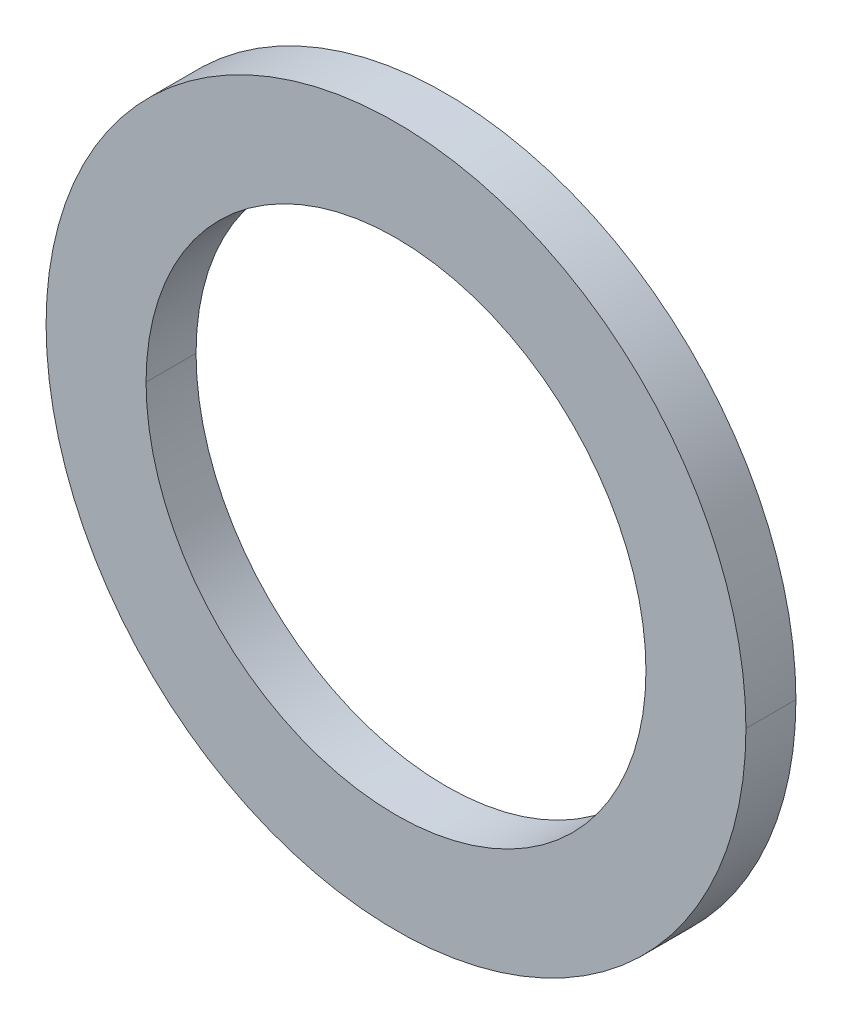
ISO-10303-21;
HEADER;
FILE_DESCRIPTION(('STEP AP214'),'2;1');
FILE_NAME('part.step','',(''),(''),'','','');
FILE_SCHEMA(('AUTOMOTIVE_DESIGN { 1 0 10303 214 1 1 1 1 }'));
ENDSEC;
DATA;
#1=APPLICATION_CONTEXT('core data for automotive mechanical design processes');
#2=APPLICATION_PROTOCOL_DEFINITION('international standard','automotive_design',2000,#1);
#3=PRODUCT_CONTEXT('',#1,'mechanical');
#4=PRODUCT('Part','Part','',(#3));
#5=PRODUCT_RELATED_PRODUCT_CATEGORY('part','',(#4));
#6=PRODUCT_DEFINITION_FORMATION('','',#4);
#7=PRODUCT_DEFINITION_CONTEXT('part definition',#1,'design');
#8=PRODUCT_DEFINITION('design','',#6,#7);
#9=PRODUCT_DEFINITION_SHAPE('','',#8);
#10=(LENGTH_UNIT() NAMED_UNIT(*) SI_UNIT(.MILLI.,.METRE.));
#11=(NAMED_UNIT(*) PLANE_ANGLE_UNIT() SI_UNIT($,.RADIAN.));
#12=(NAMED_UNIT(*) SI_UNIT($,.STERADIAN.) SOLID_ANGLE_UNIT());
#13=UNCERTAINTY_MEASURE_WITH_UNIT(LENGTH_MEASURE(1.E-05),#10,'distance_accuracy_value','');
#14=(GEOMETRIC_REPRESENTATION_CONTEXT(3) GLOBAL_UNCERTAINTY_ASSIGNED_CONTEXT((#13)) GLOBAL_UNIT_ASSIGNED_CONTEXT((#10,
#11,#12)) REPRESENTATION_CONTEXT('',''));
#15=CARTESIAN_POINT('',(0.,0.,0.));
#16=DIRECTION('',(0.,0.,1.));
#17=DIRECTION('',(1.,0.,0.));
#18=AXIS2_PLACEMENT_3D('',#15,#16,#17);
#19=CARTESIAN_POINT('',(0.,0.,0.5));
#20=DIRECTION('',(0.,0.,-1.));
#21=DIRECTION('',(-1.,0.,0.));
#22=AXIS2_PLACEMENT_3D('',#19,#20,#21);
#23=CYLINDRICAL_SURFACE('',#22,2.5);
#24=DIRECTION('',(0.,0.,-1.));
#25=VECTOR('',#24,1.);
#26=CARTESIAN_POINT('',(2.5,0.,0.5));
#27=LINE('',#26,#25);
#28=CARTESIAN_POINT('',(2.5,0.,0.5));
#29=VERTEX_POINT('',#28);
#30=CARTESIAN_POINT('',(2.5,0.,0.));
#31=VERTEX_POINT('',#30);
#32=EDGE_CURVE('E87',#29,#31,#27,.T.);
#33=ORIENTED_EDGE('',*,*,#32,.F.);
#34=CARTESIAN_POINT('',(0.,0.,0.5));
#35=DIRECTION('',(0.,0.,1.));
#36=DIRECTION('',(1.,0.,0.));
#37=AXIS2_PLACEMENT_3D('',#34,#35,#36);
#38=CIRCLE('',#37,2.5);
#39=CARTESIAN_POINT('',(-2.5,0.,0.5));
#40=VERTEX_POINT('',#39);
#41=EDGE_CURVE('E60',#29,#40,#38,.T.);
#42=ORIENTED_EDGE('',*,*,#41,.T.);
#43=DIRECTION('',(0.,0.,-1.));
#44=VECTOR('',#43,1.);
#45=CARTESIAN_POINT('',(-2.5,0.,0.5));
#46=LINE('',#45,#44);
#47=CARTESIAN_POINT('',(-2.5,0.,0.));
#48=VERTEX_POINT('',#47);
#49=EDGE_CURVE('E81',#40,#48,#46,.T.);
#50=ORIENTED_EDGE('',*,*,#49,.T.);
#51=CARTESIAN_POINT('',(0.,0.,0.));
#52=DIRECTION('',(0.,0.,1.));
#53=DIRECTION('',(1.,0.,0.));
#54=AXIS2_PLACEMENT_3D('',#51,#52,#53);
#55=CIRCLE('',#54,2.5);
#56=EDGE_CURVE('E11',#31,#48,#55,.T.);
#57=ORIENTED_EDGE('',*,*,#56,.F.);
#58=EDGE_LOOP('',(#33,#42,#50,#57));
#59=FACE_BOUND('',#58,.T.);
#60=ADVANCED_FACE('F17',(#59),#23,.F.);
#61=CARTESIAN_POINT('',(0.,0.,0.5));
#62=DIRECTION('',(0.,0.,-1.));
#63=DIRECTION('',(-1.,0.,0.));
#64=AXIS2_PLACEMENT_3D('',#61,#62,#63);
#65=CYLINDRICAL_SURFACE('',#64,3.5);
#66=DIRECTION('',(0.,0.,-1.));
#67=VECTOR('',#66,1.);
#68=CARTESIAN_POINT('',(3.5,0.,0.5));
#69=LINE('',#68,#67);
#70=CARTESIAN_POINT('',(3.5,0.,0.5));
#71=VERTEX_POINT('',#70);
#72=CARTESIAN_POINT('',(3.5,0.,0.));
#73=VERTEX_POINT('',#72);
#74=EDGE_CURVE('E117',#71,#73,#69,.T.);
#75=ORIENTED_EDGE('',*,*,#74,.F.);
#76=CARTESIAN_POINT('',(0.,0.,0.5));
#77=DIRECTION('',(0.,0.,1.));
#78=DIRECTION('',(1.,0.,0.));
#79=AXIS2_PLACEMENT_3D('',#76,#77,#78);
#80=CIRCLE('',#79,3.5);
#81=CARTESIAN_POINT('',(-3.5,0.,0.5));
#82=VERTEX_POINT('',#81);
#83=EDGE_CURVE('E99',#82,#71,#80,.T.);
#84=ORIENTED_EDGE('',*,*,#83,.F.);
#85=DIRECTION('',(0.,0.,-1.));
#86=VECTOR('',#85,1.);
#87=CARTESIAN_POINT('',(-3.5,0.,0.5));
#88=LINE('',#87,#86);
#89=CARTESIAN_POINT('',(-3.5,0.,0.));
#90=VERTEX_POINT('',#89);
#91=EDGE_CURVE('E104',#82,#90,#88,.T.);
#92=ORIENTED_EDGE('',*,*,#91,.T.);
#93=CARTESIAN_POINT('',(0.,0.,0.));
#94=DIRECTION('',(0.,0.,1.));
#95=DIRECTION('',(1.,0.,0.));
#96=AXIS2_PLACEMENT_3D('',#93,#94,#95);
#97=CIRCLE('',#96,3.5);
#98=EDGE_CURVE('E28',#90,#73,#97,.T.);
#99=ORIENTED_EDGE('',*,*,#98,.T.);
#100=EDGE_LOOP('',(#75,#84,#92,#99));
#101=FACE_BOUND('',#100,.T.);
#102=ADVANCED_FACE('F19',(#101),#65,.T.);
#103=CARTESIAN_POINT('',(0.,0.,0.));
#104=DIRECTION('',(0.,0.,1.));
#105=DIRECTION('',(1.,0.,0.));
#106=AXIS2_PLACEMENT_3D('',#103,#104,#105);
#107=PLANE('',#106);
#108=CARTESIAN_POINT('',(0.,0.,0.));
#109=DIRECTION('',(0.,0.,1.));
#110=DIRECTION('',(1.,0.,0.));
#111=AXIS2_PLACEMENT_3D('',#108,#109,#110);
#112=CIRCLE('',#111,2.5);
#113=EDGE_CURVE('E79',#48,#31,#112,.T.);
#114=ORIENTED_EDGE('',*,*,#113,.T.);
#115=ORIENTED_EDGE('',*,*,#56,.T.);
#116=EDGE_LOOP('',(#114,#115));
#117=FACE_BOUND('',#116,.T.);
#118=ORIENTED_EDGE('',*,*,#98,.F.);
#119=CARTESIAN_POINT('',(0.,0.,0.));
#120=DIRECTION('',(0.,0.,1.));
#121=DIRECTION('',(1.,0.,0.));
#122=AXIS2_PLACEMENT_3D('',#119,#120,#121);
#123=CIRCLE('',#122,3.5);
#124=EDGE_CURVE('E113',#73,#90,#123,.T.);
#125=ORIENTED_EDGE('',*,*,#124,.F.);
#126=EDGE_LOOP('',(#118,#125));
#127=FACE_BOUND('',#126,.T.);
#128=ADVANCED_FACE('F77',(#117,#127),#107,.F.);
#129=CARTESIAN_POINT('',(0.,0.,0.5));
#130=DIRECTION('',(0.,0.,1.));
#131=DIRECTION('',(1.,0.,0.));
#132=AXIS2_PLACEMENT_3D('',#129,#130,#131);
#133=PLANE('',#132);
#134=CARTESIAN_POINT('',(0.,0.,0.5));
#135=DIRECTION('',(0.,0.,1.));
#136=DIRECTION('',(1.,0.,0.));
#137=AXIS2_PLACEMENT_3D('',#134,#135,#136);
#138=CIRCLE('',#137,2.5);
#139=EDGE_CURVE('E94',#40,#29,#138,.T.);
#140=ORIENTED_EDGE('',*,*,#139,.F.);
#141=ORIENTED_EDGE('',*,*,#41,.F.);
#142=EDGE_LOOP('',(#140,#141));
#143=FACE_BOUND('',#142,.T.);
#144=ORIENTED_EDGE('',*,*,#83,.T.);
#145=CARTESIAN_POINT('',(0.,0.,0.5));
#146=DIRECTION('',(0.,0.,1.));
#147=DIRECTION('',(1.,0.,0.));
#148=AXIS2_PLACEMENT_3D('',#145,#146,#147);
#149=CIRCLE('',#148,3.5);
#150=EDGE_CURVE('E21',#71,#82,#149,.T.);
#151=ORIENTED_EDGE('',*,*,#150,.T.);
#152=EDGE_LOOP('',(#144,#151));
#153=FACE_BOUND('',#152,.T.);
#154=ADVANCED_FACE('F123',(#143,#153),#133,.T.);
#155=CARTESIAN_POINT('',(0.,0.,0.5));
#156=DIRECTION('',(0.,0.,-1.));
#157=DIRECTION('',(-1.,0.,0.));
#158=AXIS2_PLACEMENT_3D('',#155,#156,#157);
#159=CYLINDRICAL_SURFACE('',#158,3.5);
#160=ORIENTED_EDGE('',*,*,#150,.F.);
#161=ORIENTED_EDGE('',*,*,#74,.T.);
#162=ORIENTED_EDGE('',*,*,#124,.T.);
#163=ORIENTED_EDGE('',*,*,#91,.F.);
#164=EDGE_LOOP('',(#160,#161,#162,#163));
#165=FACE_BOUND('',#164,.T.);
#166=ADVANCED_FACE('F125',(#165),#159,.T.);
#167=CARTESIAN_POINT('',(0.,0.,0.5));
#168=DIRECTION('',(0.,0.,-1.));
#169=DIRECTION('',(-1.,0.,0.));
#170=AXIS2_PLACEMENT_3D('',#167,#168,#169);
#171=CYLINDRICAL_SURFACE('',#170,2.5);
#172=ORIENTED_EDGE('',*,*,#139,.T.);
#173=ORIENTED_EDGE('',*,*,#32,.T.);
#174=ORIENTED_EDGE('',*,*,#113,.F.);
#175=ORIENTED_EDGE('',*,*,#49,.F.);
#176=EDGE_LOOP('',(#172,#173,#174,#175));
#177=FACE_BOUND('',#176,.T.);
#178=ADVANCED_FACE('F86',(#177),#171,.F.);
#179=CLOSED_SHELL('',(#60,#102,#128,#154,#166,#178));
#180=MANIFOLD_SOLID_BREP('B1',#179);
#181=ADVANCED_BREP_SHAPE_REPRESENTATION('',(#18,#180),#14);
#182=SHAPE_DEFINITION_REPRESENTATION(#9,#181);
ENDSEC;
END-ISO-10303-21;
